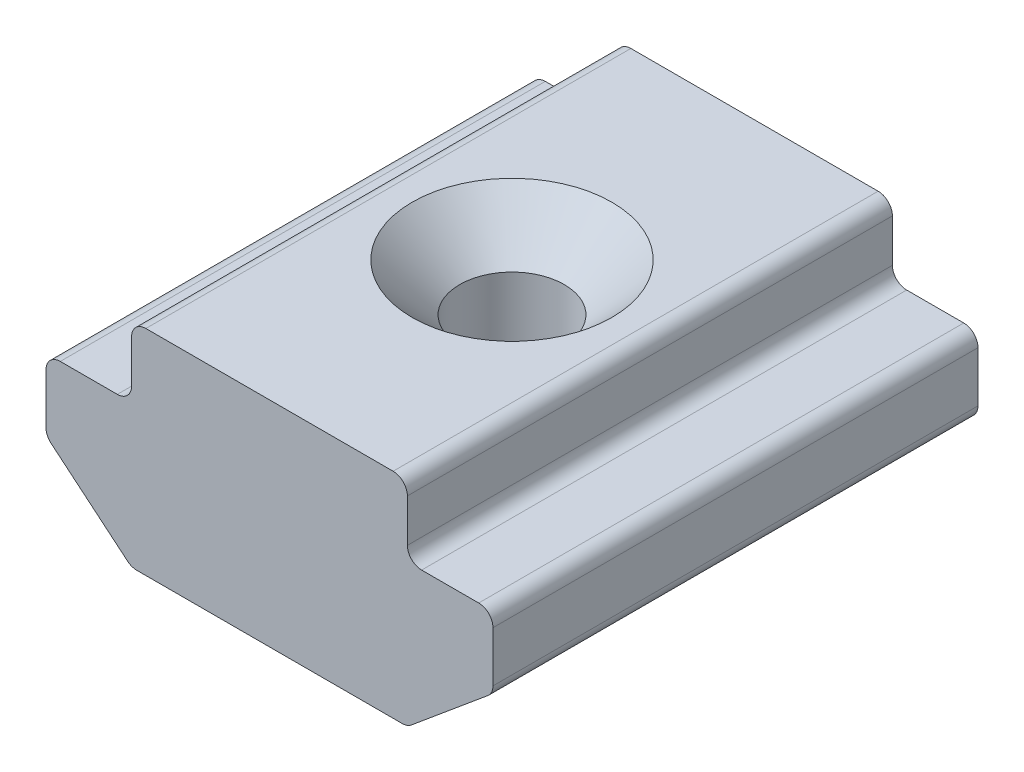
ISO-10303-21;
HEADER;
FILE_DESCRIPTION(('STEP AP214'),'2;1');
FILE_NAME('part.step','',(''),(''),'','','');
FILE_SCHEMA(('AUTOMOTIVE_DESIGN { 1 0 10303 214 1 1 1 1 }'));
ENDSEC;
DATA;
#1=APPLICATION_CONTEXT('core data for automotive mechanical design processes');
#2=APPLICATION_PROTOCOL_DEFINITION('international standard','automotive_design',2000,#1);
#3=PRODUCT_CONTEXT('',#1,'mechanical');
#4=PRODUCT('Part','Part','',(#3));
#5=PRODUCT_RELATED_PRODUCT_CATEGORY('part','',(#4));
#6=PRODUCT_DEFINITION_FORMATION('','',#4);
#7=PRODUCT_DEFINITION_CONTEXT('part definition',#1,'design');
#8=PRODUCT_DEFINITION('design','',#6,#7);
#9=PRODUCT_DEFINITION_SHAPE('','',#8);
#10=(LENGTH_UNIT() NAMED_UNIT(*) SI_UNIT(.MILLI.,.METRE.));
#11=(NAMED_UNIT(*) PLANE_ANGLE_UNIT() SI_UNIT($,.RADIAN.));
#12=(NAMED_UNIT(*) SI_UNIT($,.STERADIAN.) SOLID_ANGLE_UNIT());
#13=UNCERTAINTY_MEASURE_WITH_UNIT(LENGTH_MEASURE(1.E-05),#10,'distance_accuracy_value','');
#14=(GEOMETRIC_REPRESENTATION_CONTEXT(3) GLOBAL_UNCERTAINTY_ASSIGNED_CONTEXT((#13)) GLOBAL_UNIT_ASSIGNED_CONTEXT((#10,
#11,#12)) REPRESENTATION_CONTEXT('',''));
#15=CARTESIAN_POINT('',(0.,0.,0.));
#16=DIRECTION('',(0.,0.,1.));
#17=DIRECTION('',(1.,0.,0.));
#18=AXIS2_PLACEMENT_3D('',#15,#16,#17);
#19=CARTESIAN_POINT('',(-4.88052262243209,4.32454322778494,3.5065603110821));
#20=DIRECTION('',(1.,0.,0.));
#21=DIRECTION('',(0.,0.,-1.));
#22=AXIS2_PLACEMENT_3D('',#19,#20,#21);
#23=PLANE('',#22);
#24=DIRECTION('',(0.,-1.,0.));
#25=VECTOR('',#24,1.);
#26=CARTESIAN_POINT('',(-4.88052262243209,4.32454322778494,3.5065603110821));
#27=LINE('',#26,#25);
#28=CARTESIAN_POINT('',(-4.88052262243209,5.52454322778494,3.5065603110821));
#29=VERTEX_POINT('',#28);
#30=CARTESIAN_POINT('',(-4.88052262243209,4.62454322778494,3.5065603110821));
#31=VERTEX_POINT('',#30);
#32=EDGE_CURVE('E199',#29,#31,#27,.T.);
#33=ORIENTED_EDGE('',*,*,#32,.F.);
#34=DIRECTION('',(0.,0.,-1.));
#35=VECTOR('',#34,1.);
#36=CARTESIAN_POINT('',(-4.88052262243209,5.52454322778494,3.5065603110821));
#37=LINE('',#36,#35);
#38=CARTESIAN_POINT('',(-4.88052262243209,5.52454322778494,-6.6934396889179));
#39=VERTEX_POINT('',#38);
#40=EDGE_CURVE('E252',#29,#39,#37,.T.);
#41=ORIENTED_EDGE('',*,*,#40,.T.);
#42=DIRECTION('',(0.,-1.,0.));
#43=VECTOR('',#42,1.);
#44=CARTESIAN_POINT('',(-4.88052262243209,4.32454322778494,-6.6934396889179));
#45=LINE('',#44,#43);
#46=CARTESIAN_POINT('',(-4.88052262243209,4.62454322778494,-6.6934396889179));
#47=VERTEX_POINT('',#46);
#48=EDGE_CURVE('E362',#39,#47,#45,.T.);
#49=ORIENTED_EDGE('',*,*,#48,.T.);
#50=DIRECTION('',(0.,0.,-1.));
#51=VECTOR('',#50,1.);
#52=CARTESIAN_POINT('',(-4.88052262243209,4.62454322778494,3.5065603110821));
#53=LINE('',#52,#51);
#54=EDGE_CURVE('E250',#47,#31,#53,.F.);
#55=ORIENTED_EDGE('',*,*,#54,.T.);
#56=EDGE_LOOP('',(#33,#41,#49,#55));
#57=FACE_BOUND('',#56,.T.);
#58=ADVANCED_FACE('F16',(#57),#23,.F.);
#59=CARTESIAN_POINT('',(-6.68052262243209,4.32454322778494,3.5065603110821));
#60=DIRECTION('',(0.,-1.,0.));
#61=DIRECTION('',(0.,0.,-1.));
#62=AXIS2_PLACEMENT_3D('',#59,#60,#61);
#63=PLANE('',#62);
#64=DIRECTION('',(-1.,0.,0.));
#65=VECTOR('',#64,1.);
#66=CARTESIAN_POINT('',(-6.68052262243209,4.32454322778494,3.5065603110821));
#67=LINE('',#66,#65);
#68=CARTESIAN_POINT('',(-5.18052262243209,4.32454322778494,3.5065603110821));
#69=VERTEX_POINT('',#68);
#70=CARTESIAN_POINT('',(-6.38052262243209,4.32454322778494,3.5065603110821));
#71=VERTEX_POINT('',#70);
#72=EDGE_CURVE('E390',#69,#71,#67,.T.);
#73=ORIENTED_EDGE('',*,*,#72,.F.);
#74=DIRECTION('',(0.,0.,-1.));
#75=VECTOR('',#74,1.);
#76=CARTESIAN_POINT('',(-5.18052262243209,4.32454322778494,-6.6934396889179));
#77=LINE('',#76,#75);
#78=CARTESIAN_POINT('',(-5.18052262243209,4.32454322778494,-6.6934396889179));
#79=VERTEX_POINT('',#78);
#80=EDGE_CURVE('E257',#69,#79,#77,.T.);
#81=ORIENTED_EDGE('',*,*,#80,.T.);
#82=DIRECTION('',(-1.,0.,0.));
#83=VECTOR('',#82,1.);
#84=CARTESIAN_POINT('',(-6.68052262243209,4.32454322778494,-6.6934396889179));
#85=LINE('',#84,#83);
#86=CARTESIAN_POINT('',(-6.38052262243209,4.32454322778494,-6.6934396889179));
#87=VERTEX_POINT('',#86);
#88=EDGE_CURVE('E365',#79,#87,#85,.T.);
#89=ORIENTED_EDGE('',*,*,#88,.T.);
#90=DIRECTION('',(0.,0.,-1.));
#91=VECTOR('',#90,1.);
#92=CARTESIAN_POINT('',(-6.38052262243209,4.32454322778494,3.5065603110821));
#93=LINE('',#92,#91);
#94=EDGE_CURVE('E255',#87,#71,#93,.F.);
#95=ORIENTED_EDGE('',*,*,#94,.T.);
#96=EDGE_LOOP('',(#73,#81,#89,#95));
#97=FACE_BOUND('',#96,.T.);
#98=ADVANCED_FACE('F294',(#97),#63,.F.);
#99=CARTESIAN_POINT('',(-6.68052262243209,4.32454322778494,3.5065603110821));
#100=DIRECTION('',(1.,0.,0.));
#101=DIRECTION('',(0.,1.,0.));
#102=AXIS2_PLACEMENT_3D('',#99,#100,#101);
#103=PLANE('',#102);
#104=DIRECTION('',(0.,-1.,0.));
#105=VECTOR('',#104,1.);
#106=CARTESIAN_POINT('',(-6.68052262243209,4.32454322778494,-6.6934396889179));
#107=LINE('',#106,#105);
#108=CARTESIAN_POINT('',(-6.68052262243209,4.02454322778494,-6.6934396889179));
#109=VERTEX_POINT('',#108);
#110=CARTESIAN_POINT('',(-6.68052262243209,2.96505571158028,-6.6934396889179));
#111=VERTEX_POINT('',#110);
#112=EDGE_CURVE('E369',#109,#111,#107,.T.);
#113=ORIENTED_EDGE('',*,*,#112,.T.);
#114=DIRECTION('',(0.,0.,-1.));
#115=VECTOR('',#114,1.);
#116=CARTESIAN_POINT('',(-6.68052262243209,2.96505571158028,3.5065603110821));
#117=LINE('',#116,#115);
#118=CARTESIAN_POINT('',(-6.68052262243209,2.96505571158028,3.5065603110821));
#119=VERTEX_POINT('',#118);
#120=EDGE_CURVE('E263',#111,#119,#117,.F.);
#121=ORIENTED_EDGE('',*,*,#120,.T.);
#122=DIRECTION('',(0.,-1.,0.));
#123=VECTOR('',#122,1.);
#124=CARTESIAN_POINT('',(-6.68052262243209,4.32454322778494,3.5065603110821));
#125=LINE('',#124,#123);
#126=CARTESIAN_POINT('',(-6.68052262243209,4.02454322778494,3.5065603110821));
#127=VERTEX_POINT('',#126);
#128=EDGE_CURVE('E385',#127,#119,#125,.T.);
#129=ORIENTED_EDGE('',*,*,#128,.F.);
#130=DIRECTION('',(0.,0.,-1.));
#131=VECTOR('',#130,1.);
#132=CARTESIAN_POINT('',(-6.68052262243209,4.02454322778494,3.5065603110821));
#133=LINE('',#132,#131);
#134=EDGE_CURVE('E260',#127,#109,#133,.T.);
#135=ORIENTED_EDGE('',*,*,#134,.T.);
#136=EDGE_LOOP('',(#113,#121,#129,#135));
#137=FACE_BOUND('',#136,.T.);
#138=ADVANCED_FACE('F300',(#137),#103,.F.);
#139=CARTESIAN_POINT('',(-6.68052262243209,2.82454322778494,3.5065603110821));
#140=DIRECTION('',(0.64018439966448,0.768221279597376,0.));
#141=DIRECTION('',(-0.768221279597376,0.64018439966448,0.));
#142=AXIS2_PLACEMENT_3D('',#139,#140,#141);
#143=PLANE('',#142);
#144=DIRECTION('',(0.768221279597376,-0.64018439966448,0.));
#145=VECTOR('',#144,1.);
#146=CARTESIAN_POINT('',(-6.68052262243209,2.82454322778494,-6.6934396889179));
#147=LINE('',#146,#145);
#148=CARTESIAN_POINT('',(-6.57257794233143,2.73458932770106,-6.6934396889179));
#149=VERTEX_POINT('',#148);
#150=CARTESIAN_POINT('',(-4.96396296177703,1.39407684390573,-6.6934396889179));
#151=VERTEX_POINT('',#150);
#152=EDGE_CURVE('E188',#149,#151,#147,.T.);
#153=ORIENTED_EDGE('',*,*,#152,.T.);
#154=DIRECTION('',(0.,0.,-1.));
#155=VECTOR('',#154,1.);
#156=CARTESIAN_POINT('',(-4.96396296177703,1.39407684390573,3.5065603110821));
#157=LINE('',#156,#155);
#158=CARTESIAN_POINT('',(-4.96396296177703,1.39407684390573,3.5065603110821));
#159=VERTEX_POINT('',#158);
#160=EDGE_CURVE('E234',#151,#159,#157,.F.);
#161=ORIENTED_EDGE('',*,*,#160,.T.);
#162=DIRECTION('',(0.768221279597376,-0.64018439966448,0.));
#163=VECTOR('',#162,1.);
#164=CARTESIAN_POINT('',(-6.68052262243209,2.82454322778494,3.5065603110821));
#165=LINE('',#164,#163);
#166=CARTESIAN_POINT('',(-6.57257794233143,2.73458932770106,3.5065603110821));
#167=VERTEX_POINT('',#166);
#168=EDGE_CURVE('E382',#167,#159,#165,.T.);
#169=ORIENTED_EDGE('',*,*,#168,.F.);
#170=DIRECTION('',(0.,0.,-1.));
#171=VECTOR('',#170,1.);
#172=CARTESIAN_POINT('',(-6.57257794233143,2.73458932770106,3.5065603110821));
#173=LINE('',#172,#171);
#174=EDGE_CURVE('E231',#167,#149,#173,.T.);
#175=ORIENTED_EDGE('',*,*,#174,.T.);
#176=EDGE_LOOP('',(#153,#161,#169,#175));
#177=FACE_BOUND('',#176,.T.);
#178=ADVANCED_FACE('F375',(#177),#143,.F.);
#179=CARTESIAN_POINT('',(0.919477377567912,1.32454322778494,3.5065603110821));
#180=DIRECTION('',(0.,1.,0.));
#181=DIRECTION('',(-1.,0.,0.));
#182=AXIS2_PLACEMENT_3D('',#179,#180,#181);
#183=PLANE('',#182);
#184=CARTESIAN_POINT('',(-1.98052262243209,1.32454322778494,-1.5934396889179));
#185=DIRECTION('',(0.,1.,0.));
#186=DIRECTION('',(-1.,0.,0.));
#187=AXIS2_PLACEMENT_3D('',#184,#185,#186);
#188=CIRCLE('',#187,1.1);
#189=CARTESIAN_POINT('',(-3.08052262243209,1.32454322778494,-1.5934396889179));
#190=VERTEX_POINT('',#189);
#191=EDGE_CURVE('E366',#190,#190,#188,.T.);
#192=ORIENTED_EDGE('',*,*,#191,.T.);
#193=EDGE_LOOP('',(#192));
#194=FACE_BOUND('',#193,.T.);
#195=DIRECTION('',(1.,0.,0.));
#196=VECTOR('',#195,1.);
#197=CARTESIAN_POINT('',(0.919477377567912,1.32454322778494,-6.6934396889179));
#198=LINE('',#197,#196);
#199=CARTESIAN_POINT('',(-4.77190764187769,1.32454322778494,-6.6934396889179));
#200=VERTEX_POINT('',#199);
#201=CARTESIAN_POINT('',(0.810862397013513,1.32454322778494,-6.6934396889179));
#202=VERTEX_POINT('',#201);
#203=EDGE_CURVE('E183',#200,#202,#198,.T.);
#204=ORIENTED_EDGE('',*,*,#203,.T.);
#205=DIRECTION('',(0.,0.,-1.));
#206=VECTOR('',#205,1.);
#207=CARTESIAN_POINT('',(0.810862397013513,1.32454322778494,3.5065603110821));
#208=LINE('',#207,#206);
#209=CARTESIAN_POINT('',(0.810862397013513,1.32454322778494,3.5065603110821));
#210=VERTEX_POINT('',#209);
#211=EDGE_CURVE('E160',#202,#210,#208,.F.);
#212=ORIENTED_EDGE('',*,*,#211,.T.);
#213=DIRECTION('',(1.,0.,0.));
#214=VECTOR('',#213,1.);
#215=CARTESIAN_POINT('',(0.919477377567912,1.32454322778494,3.5065603110821));
#216=LINE('',#215,#214);
#217=CARTESIAN_POINT('',(-4.77190764187769,1.32454322778494,3.5065603110821));
#218=VERTEX_POINT('',#217);
#219=EDGE_CURVE('E356',#218,#210,#216,.T.);
#220=ORIENTED_EDGE('',*,*,#219,.F.);
#221=DIRECTION('',(0.,0.,-1.));
#222=VECTOR('',#221,1.);
#223=CARTESIAN_POINT('',(-4.77190764187769,1.32454322778494,3.5065603110821));
#224=LINE('',#223,#222);
#225=EDGE_CURVE('E165',#218,#200,#224,.T.);
#226=ORIENTED_EDGE('',*,*,#225,.T.);
#227=EDGE_LOOP('',(#204,#212,#220,#226));
#228=FACE_BOUND('',#227,.T.);
#229=ADVANCED_FACE('F384',(#194,#228),#183,.F.);
#230=CARTESIAN_POINT('',(2.71947737756791,2.82454322778494,3.5065603110821));
#231=DIRECTION('',(-0.64018439966448,0.768221279597376,0.));
#232=DIRECTION('',(-0.768221279597376,-0.64018439966448,0.));
#233=AXIS2_PLACEMENT_3D('',#230,#231,#232);
#234=PLANE('',#233);
#235=DIRECTION('',(0.768221279597376,0.64018439966448,0.));
#236=VECTOR('',#235,1.);
#237=CARTESIAN_POINT('',(2.71947737756791,2.82454322778494,3.5065603110821));
#238=LINE('',#237,#236);
#239=CARTESIAN_POINT('',(1.00291771691286,1.39407684390573,3.5065603110821));
#240=VERTEX_POINT('',#239);
#241=CARTESIAN_POINT('',(2.61153269746725,2.73458932770106,3.5065603110821));
#242=VERTEX_POINT('',#241);
#243=EDGE_CURVE('E175',#240,#242,#238,.T.);
#244=ORIENTED_EDGE('',*,*,#243,.F.);
#245=DIRECTION('',(0.,0.,-1.));
#246=VECTOR('',#245,1.);
#247=CARTESIAN_POINT('',(1.00291771691286,1.39407684390573,3.5065603110821));
#248=LINE('',#247,#246);
#249=CARTESIAN_POINT('',(1.00291771691286,1.39407684390573,-6.6934396889179));
#250=VERTEX_POINT('',#249);
#251=EDGE_CURVE('E159',#240,#250,#248,.T.);
#252=ORIENTED_EDGE('',*,*,#251,.T.);
#253=DIRECTION('',(0.768221279597376,0.64018439966448,0.));
#254=VECTOR('',#253,1.);
#255=CARTESIAN_POINT('',(2.71947737756791,2.82454322778494,-6.6934396889179));
#256=LINE('',#255,#254);
#257=CARTESIAN_POINT('',(2.61153269746725,2.73458932770106,-6.6934396889179));
#258=VERTEX_POINT('',#257);
#259=EDGE_CURVE('E172',#250,#258,#256,.T.);
#260=ORIENTED_EDGE('',*,*,#259,.T.);
#261=DIRECTION('',(0.,0.,-1.));
#262=VECTOR('',#261,1.);
#263=CARTESIAN_POINT('',(2.61153269746725,2.73458932770106,3.5065603110821));
#264=LINE('',#263,#262);
#265=EDGE_CURVE('E177',#258,#242,#264,.F.);
#266=ORIENTED_EDGE('',*,*,#265,.T.);
#267=EDGE_LOOP('',(#244,#252,#260,#266));
#268=FACE_BOUND('',#267,.T.);
#269=ADVANCED_FACE('F171',(#268),#234,.F.);
#270=CARTESIAN_POINT('',(2.71947737756791,4.32454322778494,3.5065603110821));
#271=DIRECTION('',(-1.,0.,0.));
#272=DIRECTION('',(0.,0.,1.));
#273=AXIS2_PLACEMENT_3D('',#270,#271,#272);
#274=PLANE('',#273);
#275=DIRECTION('',(0.,1.,0.));
#276=VECTOR('',#275,1.);
#277=CARTESIAN_POINT('',(2.71947737756791,4.32454322778494,3.5065603110821));
#278=LINE('',#277,#276);
#279=CARTESIAN_POINT('',(2.71947737756791,2.96505571158028,3.5065603110821));
#280=VERTEX_POINT('',#279);
#281=CARTESIAN_POINT('',(2.71947737756791,4.02454322778494,3.5065603110821));
#282=VERTEX_POINT('',#281);
#283=EDGE_CURVE('E346',#280,#282,#278,.T.);
#284=ORIENTED_EDGE('',*,*,#283,.F.);
#285=DIRECTION('',(0.,0.,-1.));
#286=VECTOR('',#285,1.);
#287=CARTESIAN_POINT('',(2.71947737756791,2.96505571158028,3.5065603110821));
#288=LINE('',#287,#286);
#289=CARTESIAN_POINT('',(2.71947737756791,2.96505571158028,-6.6934396889179));
#290=VERTEX_POINT('',#289);
#291=EDGE_CURVE('E267',#280,#290,#288,.T.);
#292=ORIENTED_EDGE('',*,*,#291,.T.);
#293=DIRECTION('',(0.,1.,0.));
#294=VECTOR('',#293,1.);
#295=CARTESIAN_POINT('',(2.71947737756791,4.32454322778494,-6.6934396889179));
#296=LINE('',#295,#294);
#297=CARTESIAN_POINT('',(2.71947737756791,4.02454322778494,-6.6934396889179));
#298=VERTEX_POINT('',#297);
#299=EDGE_CURVE('E182',#290,#298,#296,.T.);
#300=ORIENTED_EDGE('',*,*,#299,.T.);
#301=DIRECTION('',(0.,0.,-1.));
#302=VECTOR('',#301,1.);
#303=CARTESIAN_POINT('',(2.71947737756791,4.02454322778494,3.5065603110821));
#304=LINE('',#303,#302);
#305=EDGE_CURVE('E265',#298,#282,#304,.F.);
#306=ORIENTED_EDGE('',*,*,#305,.T.);
#307=EDGE_LOOP('',(#284,#292,#300,#306));
#308=FACE_BOUND('',#307,.T.);
#309=ADVANCED_FACE('F349',(#308),#274,.F.);
#310=CARTESIAN_POINT('',(0.919477377567908,4.32454322778494,3.5065603110821));
#311=DIRECTION('',(0.,-1.,0.));
#312=DIRECTION('',(0.,0.,-1.));
#313=AXIS2_PLACEMENT_3D('',#310,#311,#312);
#314=PLANE('',#313);
#315=DIRECTION('',(-1.,0.,0.));
#316=VECTOR('',#315,1.);
#317=CARTESIAN_POINT('',(0.919477377567908,4.32454322778494,-6.6934396889179));
#318=LINE('',#317,#316);
#319=CARTESIAN_POINT('',(2.41947737756791,4.32454322778494,-6.6934396889179));
#320=VERTEX_POINT('',#319);
#321=CARTESIAN_POINT('',(1.21947737756791,4.32454322778494,-6.6934396889179));
#322=VERTEX_POINT('',#321);
#323=EDGE_CURVE('E186',#320,#322,#318,.T.);
#324=ORIENTED_EDGE('',*,*,#323,.T.);
#325=DIRECTION('',(0.,0.,-1.));
#326=VECTOR('',#325,1.);
#327=CARTESIAN_POINT('',(1.21947737756791,4.32454322778494,3.5065603110821));
#328=LINE('',#327,#326);
#329=CARTESIAN_POINT('',(1.21947737756791,4.32454322778494,3.5065603110821));
#330=VERTEX_POINT('',#329);
#331=EDGE_CURVE('E244',#322,#330,#328,.F.);
#332=ORIENTED_EDGE('',*,*,#331,.T.);
#333=DIRECTION('',(-1.,0.,0.));
#334=VECTOR('',#333,1.);
#335=CARTESIAN_POINT('',(0.919477377567908,4.32454322778494,3.5065603110821));
#336=LINE('',#335,#334);
#337=CARTESIAN_POINT('',(2.41947737756791,4.32454322778494,3.5065603110821));
#338=VERTEX_POINT('',#337);
#339=EDGE_CURVE('E351',#338,#330,#336,.T.);
#340=ORIENTED_EDGE('',*,*,#339,.F.);
#341=DIRECTION('',(0.,0.,-1.));
#342=VECTOR('',#341,1.);
#343=CARTESIAN_POINT('',(2.41947737756791,4.32454322778494,3.5065603110821));
#344=LINE('',#343,#342);
#345=EDGE_CURVE('E241',#338,#320,#344,.T.);
#346=ORIENTED_EDGE('',*,*,#345,.T.);
#347=EDGE_LOOP('',(#324,#332,#340,#346));
#348=FACE_BOUND('',#347,.T.);
#349=ADVANCED_FACE('F414',(#348),#314,.F.);
#350=CARTESIAN_POINT('',(0.919477377567909,5.82454322778494,3.5065603110821));
#351=DIRECTION('',(-1.,0.,0.));
#352=DIRECTION('',(0.,-1.,0.));
#353=AXIS2_PLACEMENT_3D('',#350,#351,#352);
#354=PLANE('',#353);
#355=DIRECTION('',(0.,1.,0.));
#356=VECTOR('',#355,1.);
#357=CARTESIAN_POINT('',(0.919477377567909,5.82454322778494,3.5065603110821));
#358=LINE('',#357,#356);
#359=CARTESIAN_POINT('',(0.919477377567908,4.62454322778494,3.5065603110821));
#360=VERTEX_POINT('',#359);
#361=CARTESIAN_POINT('',(0.919477377567908,5.52454322778494,3.5065603110821));
#362=VERTEX_POINT('',#361);
#363=EDGE_CURVE('E354',#360,#362,#358,.T.);
#364=ORIENTED_EDGE('',*,*,#363,.F.);
#365=DIRECTION('',(0.,0.,-1.));
#366=VECTOR('',#365,1.);
#367=CARTESIAN_POINT('',(0.919477377567908,4.62454322778494,-6.6934396889179));
#368=LINE('',#367,#366);
#369=CARTESIAN_POINT('',(0.919477377567908,4.62454322778494,-6.6934396889179));
#370=VERTEX_POINT('',#369);
#371=EDGE_CURVE('E238',#360,#370,#368,.T.);
#372=ORIENTED_EDGE('',*,*,#371,.T.);
#373=DIRECTION('',(0.,1.,0.));
#374=VECTOR('',#373,1.);
#375=CARTESIAN_POINT('',(0.919477377567909,5.82454322778494,-6.6934396889179));
#376=LINE('',#375,#374);
#377=CARTESIAN_POINT('',(0.919477377567908,5.52454322778494,-6.6934396889179));
#378=VERTEX_POINT('',#377);
#379=EDGE_CURVE('E194',#370,#378,#376,.T.);
#380=ORIENTED_EDGE('',*,*,#379,.T.);
#381=DIRECTION('',(0.,0.,-1.));
#382=VECTOR('',#381,1.);
#383=CARTESIAN_POINT('',(0.919477377567908,5.52454322778494,3.5065603110821));
#384=LINE('',#383,#382);
#385=EDGE_CURVE('E236',#378,#362,#384,.F.);
#386=ORIENTED_EDGE('',*,*,#385,.T.);
#387=EDGE_LOOP('',(#364,#372,#380,#386));
#388=FACE_BOUND('',#387,.T.);
#389=ADVANCED_FACE('F410',(#388),#354,.F.);
#390=CARTESIAN_POINT('',(-4.88052262243209,5.82454322778494,3.5065603110821));
#391=DIRECTION('',(0.,-1.,0.));
#392=DIRECTION('',(0.,0.,-1.));
#393=AXIS2_PLACEMENT_3D('',#390,#391,#392);
#394=PLANE('',#393);
#395=CARTESIAN_POINT('',(-1.98052262243209,5.82454322778494,-1.5934396889179));
#396=DIRECTION('',(0.,-1.,0.));
#397=DIRECTION('',(0.,0.,-1.));
#398=AXIS2_PLACEMENT_3D('',#395,#396,#397);
#399=CIRCLE('',#398,2.1);
#400=CARTESIAN_POINT('',(-1.98052262243209,5.82454322778494,-3.6934396889179));
#401=VERTEX_POINT('',#400);
#402=EDGE_CURVE('E10',#401,#401,#399,.T.);
#403=ORIENTED_EDGE('',*,*,#402,.T.);
#404=EDGE_LOOP('',(#403));
#405=FACE_BOUND('',#404,.T.);
#406=DIRECTION('',(-1.,0.,0.));
#407=VECTOR('',#406,1.);
#408=CARTESIAN_POINT('',(-4.88052262243209,5.82454322778494,3.5065603110821));
#409=LINE('',#408,#407);
#410=CARTESIAN_POINT('',(0.619477377567909,5.82454322778494,3.5065603110821));
#411=VERTEX_POINT('',#410);
#412=CARTESIAN_POINT('',(-4.58052262243209,5.82454322778494,3.5065603110821));
#413=VERTEX_POINT('',#412);
#414=EDGE_CURVE('E200',#411,#413,#409,.T.);
#415=ORIENTED_EDGE('',*,*,#414,.F.);
#416=DIRECTION('',(0.,0.,-1.));
#417=VECTOR('',#416,1.);
#418=CARTESIAN_POINT('',(0.619477377567909,5.82454322778494,3.5065603110821));
#419=LINE('',#418,#417);
#420=CARTESIAN_POINT('',(0.619477377567909,5.82454322778494,-6.6934396889179));
#421=VERTEX_POINT('',#420);
#422=EDGE_CURVE('E247',#411,#421,#419,.T.);
#423=ORIENTED_EDGE('',*,*,#422,.T.);
#424=DIRECTION('',(-1.,0.,0.));
#425=VECTOR('',#424,1.);
#426=CARTESIAN_POINT('',(-4.88052262243209,5.82454322778494,-6.6934396889179));
#427=LINE('',#426,#425);
#428=CARTESIAN_POINT('',(-4.58052262243209,5.82454322778494,-6.6934396889179));
#429=VERTEX_POINT('',#428);
#430=EDGE_CURVE('E197',#421,#429,#427,.T.);
#431=ORIENTED_EDGE('',*,*,#430,.T.);
#432=DIRECTION('',(0.,0.,-1.));
#433=VECTOR('',#432,1.);
#434=CARTESIAN_POINT('',(-4.58052262243209,5.82454322778494,3.5065603110821));
#435=LINE('',#434,#433);
#436=EDGE_CURVE('E31',#429,#413,#435,.F.);
#437=ORIENTED_EDGE('',*,*,#436,.T.);
#438=EDGE_LOOP('',(#415,#423,#431,#437));
#439=FACE_BOUND('',#438,.T.);
#440=ADVANCED_FACE('F406',(#405,#439),#394,.F.);
#441=CARTESIAN_POINT('',(-1.98052262243209,3.57454322778494,3.5065603110821));
#442=DIRECTION('',(0.,0.,-1.));
#443=DIRECTION('',(-1.,0.,0.));
#444=AXIS2_PLACEMENT_3D('',#441,#442,#443);
#445=PLANE('',#444);
#446=ORIENTED_EDGE('',*,*,#219,.T.);
#447=CARTESIAN_POINT('',(0.810862397013513,1.62454322778494,3.5065603110821));
#448=DIRECTION('',(0.,0.,-1.));
#449=DIRECTION('',(-1.,0.,0.));
#450=AXIS2_PLACEMENT_3D('',#447,#448,#449);
#451=CIRCLE('',#450,0.3);
#452=EDGE_CURVE('E229',#210,#240,#451,.F.);
#453=ORIENTED_EDGE('',*,*,#452,.T.);
#454=ORIENTED_EDGE('',*,*,#243,.T.);
#455=CARTESIAN_POINT('',(2.41947737756791,2.96505571158028,3.5065603110821));
#456=DIRECTION('',(0.,0.,-1.));
#457=DIRECTION('',(-1.,0.,0.));
#458=AXIS2_PLACEMENT_3D('',#455,#456,#457);
#459=CIRCLE('',#458,0.3);
#460=EDGE_CURVE('E218',#242,#280,#459,.F.);
#461=ORIENTED_EDGE('',*,*,#460,.T.);
#462=ORIENTED_EDGE('',*,*,#283,.T.);
#463=CARTESIAN_POINT('',(2.41947737756791,4.02454322778494,3.5065603110821));
#464=DIRECTION('',(0.,0.,-1.));
#465=DIRECTION('',(-1.,0.,0.));
#466=AXIS2_PLACEMENT_3D('',#463,#464,#465);
#467=CIRCLE('',#466,0.3);
#468=EDGE_CURVE('E216',#282,#338,#467,.F.);
#469=ORIENTED_EDGE('',*,*,#468,.T.);
#470=ORIENTED_EDGE('',*,*,#339,.T.);
#471=CARTESIAN_POINT('',(1.21947737756791,4.62454322778494,3.5065603110821));
#472=DIRECTION('',(0.,0.,-1.));
#473=DIRECTION('',(-1.,0.,0.));
#474=AXIS2_PLACEMENT_3D('',#471,#472,#473);
#475=CIRCLE('',#474,0.3);
#476=EDGE_CURVE('E272',#330,#360,#475,.T.);
#477=ORIENTED_EDGE('',*,*,#476,.T.);
#478=ORIENTED_EDGE('',*,*,#363,.T.);
#479=CARTESIAN_POINT('',(0.619477377567909,5.52454322778494,3.5065603110821));
#480=DIRECTION('',(0.,0.,-1.));
#481=DIRECTION('',(-1.,0.,0.));
#482=AXIS2_PLACEMENT_3D('',#479,#480,#481);
#483=CIRCLE('',#482,0.3);
#484=EDGE_CURVE('E38',#362,#411,#483,.F.);
#485=ORIENTED_EDGE('',*,*,#484,.T.);
#486=ORIENTED_EDGE('',*,*,#414,.T.);
#487=CARTESIAN_POINT('',(-4.58052262243209,5.52454322778494,3.5065603110821));
#488=DIRECTION('',(0.,0.,-1.));
#489=DIRECTION('',(-1.,0.,0.));
#490=AXIS2_PLACEMENT_3D('',#487,#488,#489);
#491=CIRCLE('',#490,0.3);
#492=EDGE_CURVE('E224',#413,#29,#491,.F.);
#493=ORIENTED_EDGE('',*,*,#492,.T.);
#494=ORIENTED_EDGE('',*,*,#32,.T.);
#495=CARTESIAN_POINT('',(-5.18052262243209,4.62454322778494,3.5065603110821));
#496=DIRECTION('',(0.,0.,-1.));
#497=DIRECTION('',(-1.,0.,0.));
#498=AXIS2_PLACEMENT_3D('',#495,#496,#497);
#499=CIRCLE('',#498,0.3);
#500=EDGE_CURVE('E276',#31,#69,#499,.T.);
#501=ORIENTED_EDGE('',*,*,#500,.T.);
#502=ORIENTED_EDGE('',*,*,#72,.T.);
#503=CARTESIAN_POINT('',(-6.38052262243209,4.02454322778494,3.5065603110821));
#504=DIRECTION('',(0.,0.,-1.));
#505=DIRECTION('',(-1.,0.,0.));
#506=AXIS2_PLACEMENT_3D('',#503,#504,#505);
#507=CIRCLE('',#506,0.3);
#508=EDGE_CURVE('E220',#71,#127,#507,.F.);
#509=ORIENTED_EDGE('',*,*,#508,.T.);
#510=ORIENTED_EDGE('',*,*,#128,.T.);
#511=CARTESIAN_POINT('',(-6.38052262243209,2.96505571158028,3.5065603110821));
#512=DIRECTION('',(0.,0.,-1.));
#513=DIRECTION('',(-1.,0.,0.));
#514=AXIS2_PLACEMENT_3D('',#511,#512,#513);
#515=CIRCLE('',#514,0.3);
#516=EDGE_CURVE('E222',#119,#167,#515,.F.);
#517=ORIENTED_EDGE('',*,*,#516,.T.);
#518=ORIENTED_EDGE('',*,*,#168,.T.);
#519=CARTESIAN_POINT('',(-4.77190764187769,1.62454322778494,3.5065603110821));
#520=DIRECTION('',(0.,0.,-1.));
#521=DIRECTION('',(-1.,0.,0.));
#522=AXIS2_PLACEMENT_3D('',#519,#520,#521);
#523=CIRCLE('',#522,0.3);
#524=EDGE_CURVE('E227',#159,#218,#523,.F.);
#525=ORIENTED_EDGE('',*,*,#524,.T.);
#526=EDGE_LOOP('',(#446,#453,#454,#461,#462,#469,#470,#477,#478,#485,#486,#493,#494,#501,#502,
#509,#510,#517,#518,#525));
#527=FACE_BOUND('',#526,.T.);
#528=ADVANCED_FACE('F345',(#527),#445,.F.);
#529=CARTESIAN_POINT('',(-1.98052262243209,3.57454322778494,-6.6934396889179));
#530=DIRECTION('',(0.,0.,-1.));
#531=DIRECTION('',(-1.,0.,0.));
#532=AXIS2_PLACEMENT_3D('',#529,#530,#531);
#533=PLANE('',#532);
#534=ORIENTED_EDGE('',*,*,#259,.F.);
#535=CARTESIAN_POINT('',(0.810862397013513,1.62454322778494,-6.6934396889179));
#536=DIRECTION('',(0.,0.,-1.));
#537=DIRECTION('',(-1.,0.,0.));
#538=AXIS2_PLACEMENT_3D('',#535,#536,#537);
#539=CIRCLE('',#538,0.3);
#540=EDGE_CURVE('E155',#250,#202,#539,.T.);
#541=ORIENTED_EDGE('',*,*,#540,.T.);
#542=ORIENTED_EDGE('',*,*,#203,.F.);
#543=CARTESIAN_POINT('',(-4.77190764187769,1.62454322778494,-6.6934396889179));
#544=DIRECTION('',(0.,0.,-1.));
#545=DIRECTION('',(-1.,0.,0.));
#546=AXIS2_PLACEMENT_3D('',#543,#544,#545);
#547=CIRCLE('',#546,0.3);
#548=EDGE_CURVE('E166',#200,#151,#547,.T.);
#549=ORIENTED_EDGE('',*,*,#548,.T.);
#550=ORIENTED_EDGE('',*,*,#152,.F.);
#551=CARTESIAN_POINT('',(-6.38052262243209,2.96505571158028,-6.6934396889179));
#552=DIRECTION('',(0.,0.,-1.));
#553=DIRECTION('',(-1.,0.,0.));
#554=AXIS2_PLACEMENT_3D('',#551,#552,#553);
#555=CIRCLE('',#554,0.3);
#556=EDGE_CURVE('E206',#149,#111,#555,.T.);
#557=ORIENTED_EDGE('',*,*,#556,.T.);
#558=ORIENTED_EDGE('',*,*,#112,.F.);
#559=CARTESIAN_POINT('',(-6.38052262243209,4.02454322778494,-6.6934396889179));
#560=DIRECTION('',(0.,0.,-1.));
#561=DIRECTION('',(-1.,0.,0.));
#562=AXIS2_PLACEMENT_3D('',#559,#560,#561);
#563=CIRCLE('',#562,0.3);
#564=EDGE_CURVE('E204',#109,#87,#563,.T.);
#565=ORIENTED_EDGE('',*,*,#564,.T.);
#566=ORIENTED_EDGE('',*,*,#88,.F.);
#567=CARTESIAN_POINT('',(-5.18052262243209,4.62454322778494,-6.6934396889179));
#568=DIRECTION('',(0.,0.,-1.));
#569=DIRECTION('',(-1.,0.,0.));
#570=AXIS2_PLACEMENT_3D('',#567,#568,#569);
#571=CIRCLE('',#570,0.3);
#572=EDGE_CURVE('E274',#79,#47,#571,.F.);
#573=ORIENTED_EDGE('',*,*,#572,.T.);
#574=ORIENTED_EDGE('',*,*,#48,.F.);
#575=CARTESIAN_POINT('',(-4.58052262243209,5.52454322778494,-6.6934396889179));
#576=DIRECTION('',(0.,0.,-1.));
#577=DIRECTION('',(-1.,0.,0.));
#578=AXIS2_PLACEMENT_3D('',#575,#576,#577);
#579=CIRCLE('',#578,0.3);
#580=EDGE_CURVE('E208',#39,#429,#579,.T.);
#581=ORIENTED_EDGE('',*,*,#580,.T.);
#582=ORIENTED_EDGE('',*,*,#430,.F.);
#583=CARTESIAN_POINT('',(0.619477377567909,5.52454322778494,-6.6934396889179));
#584=DIRECTION('',(0.,0.,-1.));
#585=DIRECTION('',(-1.,0.,0.));
#586=AXIS2_PLACEMENT_3D('',#583,#584,#585);
#587=CIRCLE('',#586,0.3);
#588=EDGE_CURVE('E210',#421,#378,#587,.T.);
#589=ORIENTED_EDGE('',*,*,#588,.T.);
#590=ORIENTED_EDGE('',*,*,#379,.F.);
#591=CARTESIAN_POINT('',(1.21947737756791,4.62454322778494,-6.6934396889179));
#592=DIRECTION('',(0.,0.,-1.));
#593=DIRECTION('',(-1.,0.,0.));
#594=AXIS2_PLACEMENT_3D('',#591,#592,#593);
#595=CIRCLE('',#594,0.3);
#596=EDGE_CURVE('E270',#370,#322,#595,.F.);
#597=ORIENTED_EDGE('',*,*,#596,.T.);
#598=ORIENTED_EDGE('',*,*,#323,.F.);
#599=CARTESIAN_POINT('',(2.41947737756791,4.02454322778494,-6.6934396889179));
#600=DIRECTION('',(0.,0.,-1.));
#601=DIRECTION('',(-1.,0.,0.));
#602=AXIS2_PLACEMENT_3D('',#599,#600,#601);
#603=CIRCLE('',#602,0.3);
#604=EDGE_CURVE('E176',#320,#298,#603,.T.);
#605=ORIENTED_EDGE('',*,*,#604,.T.);
#606=ORIENTED_EDGE('',*,*,#299,.F.);
#607=CARTESIAN_POINT('',(2.41947737756791,2.96505571158028,-6.6934396889179));
#608=DIRECTION('',(0.,0.,-1.));
#609=DIRECTION('',(-1.,0.,0.));
#610=AXIS2_PLACEMENT_3D('',#607,#608,#609);
#611=CIRCLE('',#610,0.3);
#612=EDGE_CURVE('E181',#290,#258,#611,.T.);
#613=ORIENTED_EDGE('',*,*,#612,.T.);
#614=EDGE_LOOP('',(#534,#541,#542,#549,#550,#557,#558,#565,#566,#573,#574,#581,#582,#589,#590,
#597,#598,#605,#606,#613));
#615=FACE_BOUND('',#614,.T.);
#616=ADVANCED_FACE('F179',(#615),#533,.T.);
#617=CARTESIAN_POINT('',(-1.98052262243209,1.32454322778494,-1.5934396889179));
#618=DIRECTION('',(0.,1.,0.));
#619=DIRECTION('',(-1.,0.,0.));
#620=AXIS2_PLACEMENT_3D('',#617,#618,#619);
#621=CYLINDRICAL_SURFACE('',#620,1.1);
#622=CARTESIAN_POINT('',(-1.98052262243209,4.82454322778494,-1.5934396889179));
#623=DIRECTION('',(0.,-1.,0.));
#624=DIRECTION('',(1.,0.,0.));
#625=AXIS2_PLACEMENT_3D('',#622,#623,#624);
#626=CIRCLE('',#625,1.1);
#627=CARTESIAN_POINT('',(-0.880522622432089,4.82454322778494,-1.5934396889179));
#628=VERTEX_POINT('',#627);
#629=EDGE_CURVE('E24',#628,#628,#626,.F.);
#630=ORIENTED_EDGE('',*,*,#629,.T.);
#631=EDGE_LOOP('',(#630));
#632=FACE_BOUND('',#631,.T.);
#633=ORIENTED_EDGE('',*,*,#191,.F.);
#634=EDGE_LOOP('',(#633));
#635=FACE_BOUND('',#634,.T.);
#636=ADVANCED_FACE('F280',(#632,#635),#621,.F.);
#637=CARTESIAN_POINT('',(0.810862397013513,1.62454322778494,3.5065603110821));
#638=DIRECTION('',(0.,0.,-1.));
#639=DIRECTION('',(-1.,0.,0.));
#640=AXIS2_PLACEMENT_3D('',#637,#638,#639);
#641=CYLINDRICAL_SURFACE('',#640,0.3);
#642=ORIENTED_EDGE('',*,*,#452,.F.);
#643=ORIENTED_EDGE('',*,*,#211,.F.);
#644=ORIENTED_EDGE('',*,*,#540,.F.);
#645=ORIENTED_EDGE('',*,*,#251,.F.);
#646=EDGE_LOOP('',(#642,#643,#644,#645));
#647=FACE_BOUND('',#646,.T.);
#648=ADVANCED_FACE('F158',(#647),#641,.T.);
#649=CARTESIAN_POINT('',(-4.77190764187769,1.62454322778494,3.5065603110821));
#650=DIRECTION('',(0.,0.,-1.));
#651=DIRECTION('',(-1.,0.,0.));
#652=AXIS2_PLACEMENT_3D('',#649,#650,#651);
#653=CYLINDRICAL_SURFACE('',#652,0.3);
#654=ORIENTED_EDGE('',*,*,#524,.F.);
#655=ORIENTED_EDGE('',*,*,#160,.F.);
#656=ORIENTED_EDGE('',*,*,#548,.F.);
#657=ORIENTED_EDGE('',*,*,#225,.F.);
#658=EDGE_LOOP('',(#654,#655,#656,#657));
#659=FACE_BOUND('',#658,.T.);
#660=ADVANCED_FACE('F308',(#659),#653,.T.);
#661=CARTESIAN_POINT('',(1.21947737756791,4.62454322778494,3.5065603110821));
#662=DIRECTION('',(0.,0.,1.));
#663=DIRECTION('',(1.,0.,0.));
#664=AXIS2_PLACEMENT_3D('',#661,#662,#663);
#665=CYLINDRICAL_SURFACE('',#664,0.3);
#666=ORIENTED_EDGE('',*,*,#476,.F.);
#667=ORIENTED_EDGE('',*,*,#331,.F.);
#668=ORIENTED_EDGE('',*,*,#596,.F.);
#669=ORIENTED_EDGE('',*,*,#371,.F.);
#670=EDGE_LOOP('',(#666,#667,#668,#669));
#671=FACE_BOUND('',#670,.T.);
#672=ADVANCED_FACE('F311',(#671),#665,.F.);
#673=CARTESIAN_POINT('',(0.619477377567909,5.52454322778494,3.5065603110821));
#674=DIRECTION('',(0.,0.,-1.));
#675=DIRECTION('',(-1.,0.,0.));
#676=AXIS2_PLACEMENT_3D('',#673,#674,#675);
#677=CYLINDRICAL_SURFACE('',#676,0.3);
#678=ORIENTED_EDGE('',*,*,#484,.F.);
#679=ORIENTED_EDGE('',*,*,#385,.F.);
#680=ORIENTED_EDGE('',*,*,#588,.F.);
#681=ORIENTED_EDGE('',*,*,#422,.F.);
#682=EDGE_LOOP('',(#678,#679,#680,#681));
#683=FACE_BOUND('',#682,.T.);
#684=ADVANCED_FACE('F315',(#683),#677,.T.);
#685=CARTESIAN_POINT('',(-4.58052262243209,5.52454322778494,3.5065603110821));
#686=DIRECTION('',(0.,0.,-1.));
#687=DIRECTION('',(-1.,0.,0.));
#688=AXIS2_PLACEMENT_3D('',#685,#686,#687);
#689=CYLINDRICAL_SURFACE('',#688,0.3);
#690=ORIENTED_EDGE('',*,*,#492,.F.);
#691=ORIENTED_EDGE('',*,*,#436,.F.);
#692=ORIENTED_EDGE('',*,*,#580,.F.);
#693=ORIENTED_EDGE('',*,*,#40,.F.);
#694=EDGE_LOOP('',(#690,#691,#692,#693));
#695=FACE_BOUND('',#694,.T.);
#696=ADVANCED_FACE('F319',(#695),#689,.T.);
#697=CARTESIAN_POINT('',(-5.18052262243209,4.62454322778494,3.5065603110821));
#698=DIRECTION('',(0.,0.,1.));
#699=DIRECTION('',(1.,0.,0.));
#700=AXIS2_PLACEMENT_3D('',#697,#698,#699);
#701=CYLINDRICAL_SURFACE('',#700,0.3);
#702=ORIENTED_EDGE('',*,*,#500,.F.);
#703=ORIENTED_EDGE('',*,*,#54,.F.);
#704=ORIENTED_EDGE('',*,*,#572,.F.);
#705=ORIENTED_EDGE('',*,*,#80,.F.);
#706=EDGE_LOOP('',(#702,#703,#704,#705));
#707=FACE_BOUND('',#706,.T.);
#708=ADVANCED_FACE('F323',(#707),#701,.F.);
#709=CARTESIAN_POINT('',(-6.38052262243209,2.96505571158028,3.5065603110821));
#710=DIRECTION('',(0.,0.,-1.));
#711=DIRECTION('',(-1.,0.,0.));
#712=AXIS2_PLACEMENT_3D('',#709,#710,#711);
#713=CYLINDRICAL_SURFACE('',#712,0.3);
#714=ORIENTED_EDGE('',*,*,#516,.F.);
#715=ORIENTED_EDGE('',*,*,#120,.F.);
#716=ORIENTED_EDGE('',*,*,#556,.F.);
#717=ORIENTED_EDGE('',*,*,#174,.F.);
#718=EDGE_LOOP('',(#714,#715,#716,#717));
#719=FACE_BOUND('',#718,.T.);
#720=ADVANCED_FACE('F327',(#719),#713,.T.);
#721=CARTESIAN_POINT('',(-6.38052262243209,4.02454322778494,3.5065603110821));
#722=DIRECTION('',(0.,0.,-1.));
#723=DIRECTION('',(-1.,0.,0.));
#724=AXIS2_PLACEMENT_3D('',#721,#722,#723);
#725=CYLINDRICAL_SURFACE('',#724,0.3);
#726=ORIENTED_EDGE('',*,*,#508,.F.);
#727=ORIENTED_EDGE('',*,*,#94,.F.);
#728=ORIENTED_EDGE('',*,*,#564,.F.);
#729=ORIENTED_EDGE('',*,*,#134,.F.);
#730=EDGE_LOOP('',(#726,#727,#728,#729));
#731=FACE_BOUND('',#730,.T.);
#732=ADVANCED_FACE('F331',(#731),#725,.T.);
#733=CARTESIAN_POINT('',(2.41947737756791,2.96505571158028,3.5065603110821));
#734=DIRECTION('',(0.,0.,-1.));
#735=DIRECTION('',(-1.,0.,0.));
#736=AXIS2_PLACEMENT_3D('',#733,#734,#735);
#737=CYLINDRICAL_SURFACE('',#736,0.3);
#738=ORIENTED_EDGE('',*,*,#460,.F.);
#739=ORIENTED_EDGE('',*,*,#265,.F.);
#740=ORIENTED_EDGE('',*,*,#612,.F.);
#741=ORIENTED_EDGE('',*,*,#291,.F.);
#742=EDGE_LOOP('',(#738,#739,#740,#741));
#743=FACE_BOUND('',#742,.T.);
#744=ADVANCED_FACE('F290',(#743),#737,.T.);
#745=CARTESIAN_POINT('',(2.41947737756791,4.02454322778494,3.5065603110821));
#746=DIRECTION('',(0.,0.,-1.));
#747=DIRECTION('',(-1.,0.,0.));
#748=AXIS2_PLACEMENT_3D('',#745,#746,#747);
#749=CYLINDRICAL_SURFACE('',#748,0.3);
#750=ORIENTED_EDGE('',*,*,#468,.F.);
#751=ORIENTED_EDGE('',*,*,#305,.F.);
#752=ORIENTED_EDGE('',*,*,#604,.F.);
#753=ORIENTED_EDGE('',*,*,#345,.F.);
#754=EDGE_LOOP('',(#750,#751,#752,#753));
#755=FACE_BOUND('',#754,.T.);
#756=ADVANCED_FACE('F284',(#755),#749,.T.);
#757=CARTESIAN_POINT('',(-1.98052262243209,4.82454322778494,-1.5934396889179));
#758=DIRECTION('',(0.,1.,0.));
#759=DIRECTION('',(-1.,0.,0.));
#760=AXIS2_PLACEMENT_3D('',#757,#758,#759);
#761=CONICAL_SURFACE('',#760,1.1,0.78539816339745);
#762=ORIENTED_EDGE('',*,*,#402,.F.);
#763=EDGE_LOOP('',(#762));
#764=FACE_BOUND('',#763,.T.);
#765=ORIENTED_EDGE('',*,*,#629,.F.);
#766=EDGE_LOOP('',(#765));
#767=FACE_BOUND('',#766,.T.);
#768=ADVANCED_FACE('F18',(#764,#767),#761,.F.);
#769=CLOSED_SHELL('',(#58,#98,#138,#178,#229,#269,#309,#349,#389,#440,#528,#616,#636,#648,#660,
#672,#684,#696,#708,#720,#732,#744,#756,#768));
#770=MANIFOLD_SOLID_BREP('B1',#769);
#771=ADVANCED_BREP_SHAPE_REPRESENTATION('',(#18,#770),#14);
#772=SHAPE_DEFINITION_REPRESENTATION(#9,#771);
ENDSEC;
END-ISO-10303-21;
